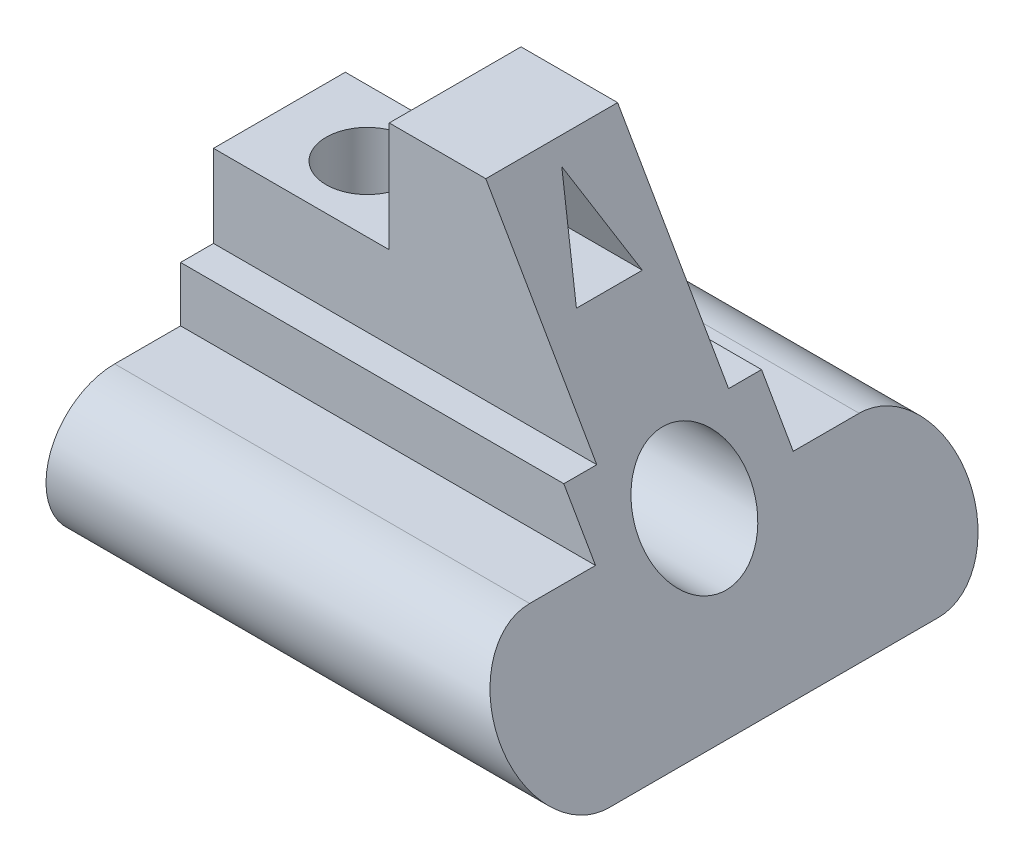
ISO-10303-21;
HEADER;
FILE_DESCRIPTION(('STEP AP214'),'2;1');
FILE_NAME('part.step','',(''),(''),'','','');
FILE_SCHEMA(('AUTOMOTIVE_DESIGN { 1 0 10303 214 1 1 1 1 }'));
ENDSEC;
DATA;
#1=APPLICATION_CONTEXT('core data for automotive mechanical design processes');
#2=APPLICATION_PROTOCOL_DEFINITION('international standard','automotive_design',2000,#1);
#3=PRODUCT_CONTEXT('',#1,'mechanical');
#4=PRODUCT('Part','Part','',(#3));
#5=PRODUCT_RELATED_PRODUCT_CATEGORY('part','',(#4));
#6=PRODUCT_DEFINITION_FORMATION('','',#4);
#7=PRODUCT_DEFINITION_CONTEXT('part definition',#1,'design');
#8=PRODUCT_DEFINITION('design','',#6,#7);
#9=PRODUCT_DEFINITION_SHAPE('','',#8);
#10=(LENGTH_UNIT() NAMED_UNIT(*) SI_UNIT(.MILLI.,.METRE.));
#11=(NAMED_UNIT(*) PLANE_ANGLE_UNIT() SI_UNIT($,.RADIAN.));
#12=(NAMED_UNIT(*) SI_UNIT($,.STERADIAN.) SOLID_ANGLE_UNIT());
#13=UNCERTAINTY_MEASURE_WITH_UNIT(LENGTH_MEASURE(1.E-05),#10,'distance_accuracy_value','');
#14=(GEOMETRIC_REPRESENTATION_CONTEXT(3) GLOBAL_UNCERTAINTY_ASSIGNED_CONTEXT((#13)) GLOBAL_UNIT_ASSIGNED_CONTEXT((#10,
#11,#12)) REPRESENTATION_CONTEXT('',''));
#15=CARTESIAN_POINT('',(0.,0.,0.));
#16=DIRECTION('',(0.,0.,1.));
#17=DIRECTION('',(1.,0.,0.));
#18=AXIS2_PLACEMENT_3D('',#15,#16,#17);
#19=CARTESIAN_POINT('',(90.,0.,-30.));
#20=DIRECTION('',(-1.,0.,0.));
#21=DIRECTION('',(0.,0.,1.));
#22=AXIS2_PLACEMENT_3D('',#19,#20,#21);
#23=CYLINDRICAL_SURFACE('',#22,12.5);
#24=CARTESIAN_POINT('',(82.7831216351296,0.,-30.));
#25=DIRECTION('',(0.866025403784438,0.500000000000001,0.));
#26=DIRECTION('',(-0.500000000000001,0.866025403784438,0.));
#27=AXIS2_PLACEMENT_3D('',#24,#25,#26);
#28=ELLIPSE('',#27,14.4337567297407,12.5);
#29=CARTESIAN_POINT('',(90.,-12.5,-30.));
#30=VERTEX_POINT('',#29);
#31=CARTESIAN_POINT('',(75.5662432702593,12.5,-30.));
#32=VERTEX_POINT('',#31);
#33=EDGE_CURVE('E233',#30,#32,#28,.T.);
#34=ORIENTED_EDGE('',*,*,#33,.F.);
#35=DIRECTION('',(-1.,0.,0.));
#36=VECTOR('',#35,1.);
#37=CARTESIAN_POINT('',(90.,-12.5,-30.));
#38=LINE('',#37,#36);
#39=CARTESIAN_POINT('',(0.,-12.5,-30.));
#40=VERTEX_POINT('',#39);
#41=EDGE_CURVE('E11',#30,#40,#38,.T.);
#42=ORIENTED_EDGE('',*,*,#41,.T.);
#43=CARTESIAN_POINT('',(0.,0.,-30.));
#44=DIRECTION('',(1.,0.,0.));
#45=DIRECTION('',(0.,0.,-1.));
#46=AXIS2_PLACEMENT_3D('',#43,#44,#45);
#47=CIRCLE('',#46,12.5);
#48=CARTESIAN_POINT('',(0.,12.5,-30.));
#49=VERTEX_POINT('',#48);
#50=EDGE_CURVE('E406',#40,#49,#47,.T.);
#51=ORIENTED_EDGE('',*,*,#50,.T.);
#52=DIRECTION('',(-1.,0.,0.));
#53=VECTOR('',#52,1.);
#54=CARTESIAN_POINT('',(90.,12.5,-30.));
#55=LINE('',#54,#53);
#56=EDGE_CURVE('E51',#32,#49,#55,.T.);
#57=ORIENTED_EDGE('',*,*,#56,.F.);
#58=EDGE_LOOP('',(#34,#42,#51,#57));
#59=FACE_BOUND('',#58,.T.);
#60=ADVANCED_FACE('F41',(#59),#23,.T.);
#61=CARTESIAN_POINT('',(90.,12.5,0.));
#62=DIRECTION('',(0.,1.,0.));
#63=DIRECTION('',(0.,0.,1.));
#64=AXIS2_PLACEMENT_3D('',#61,#62,#63);
#65=PLANE('',#64);
#66=DIRECTION('',(-1.,0.,0.));
#67=VECTOR('',#66,1.);
#68=CARTESIAN_POINT('',(90.,12.5,-18.));
#69=LINE('',#68,#67);
#70=CARTESIAN_POINT('',(75.5662432702593,12.5,-18.));
#71=VERTEX_POINT('',#70);
#72=CARTESIAN_POINT('',(0.,12.5,-18.));
#73=VERTEX_POINT('',#72);
#74=EDGE_CURVE('E396',#71,#73,#69,.T.);
#75=ORIENTED_EDGE('',*,*,#74,.F.);
#76=DIRECTION('',(0.,0.,-1.));
#77=VECTOR('',#76,1.);
#78=CARTESIAN_POINT('',(75.5662432702593,12.5,0.));
#79=LINE('',#78,#77);
#80=EDGE_CURVE('E229',#71,#32,#79,.T.);
#81=ORIENTED_EDGE('',*,*,#80,.T.);
#82=ORIENTED_EDGE('',*,*,#56,.T.);
#83=DIRECTION('',(0.,0.,-1.));
#84=VECTOR('',#83,1.);
#85=CARTESIAN_POINT('',(0.,12.5,0.));
#86=LINE('',#85,#84);
#87=EDGE_CURVE('E405',#73,#49,#86,.T.);
#88=ORIENTED_EDGE('',*,*,#87,.F.);
#89=EDGE_LOOP('',(#75,#81,#82,#88));
#90=FACE_BOUND('',#89,.T.);
#91=ADVANCED_FACE('F264',(#90),#65,.T.);
#92=CARTESIAN_POINT('',(90.,0.,-18.));
#93=DIRECTION('',(0.,0.,1.));
#94=DIRECTION('',(1.,0.,0.));
#95=AXIS2_PLACEMENT_3D('',#92,#93,#94);
#96=PLANE('',#95);
#97=DIRECTION('',(-0.500000000000001,0.866025403784438,0.));
#98=VECTOR('',#97,1.);
#99=CARTESIAN_POINT('',(84.5873412263472,-3.12500000000002,-18.));
#100=LINE('',#99,#98);
#101=CARTESIAN_POINT('',(69.792740578363,22.5,-18.));
#102=VERTEX_POINT('',#101);
#103=EDGE_CURVE('E226',#71,#102,#100,.T.);
#104=ORIENTED_EDGE('',*,*,#103,.F.);
#105=ORIENTED_EDGE('',*,*,#74,.T.);
#106=DIRECTION('',(0.,1.,0.));
#107=VECTOR('',#106,1.);
#108=CARTESIAN_POINT('',(0.,0.,-18.));
#109=LINE('',#108,#107);
#110=CARTESIAN_POINT('',(0.,22.5,-18.));
#111=VERTEX_POINT('',#110);
#112=EDGE_CURVE('E416',#73,#111,#109,.T.);
#113=ORIENTED_EDGE('',*,*,#112,.T.);
#114=DIRECTION('',(-1.,0.,0.));
#115=VECTOR('',#114,1.);
#116=CARTESIAN_POINT('',(90.,22.5,-18.));
#117=LINE('',#116,#115);
#118=EDGE_CURVE('E393',#102,#111,#117,.T.);
#119=ORIENTED_EDGE('',*,*,#118,.F.);
#120=EDGE_LOOP('',(#104,#105,#113,#119));
#121=FACE_BOUND('',#120,.T.);
#122=ADVANCED_FACE('F269',(#121),#96,.F.);
#123=CARTESIAN_POINT('',(90.,22.5,0.));
#124=DIRECTION('',(0.,1.,0.));
#125=DIRECTION('',(0.,0.,1.));
#126=AXIS2_PLACEMENT_3D('',#123,#124,#125);
#127=PLANE('',#126);
#128=DIRECTION('',(-1.,0.,0.));
#129=VECTOR('',#128,1.);
#130=CARTESIAN_POINT('',(90.,22.5,-12.));
#131=LINE('',#130,#129);
#132=CARTESIAN_POINT('',(69.792740578363,22.5,-12.));
#133=VERTEX_POINT('',#132);
#134=CARTESIAN_POINT('',(0.,22.5,-12.));
#135=VERTEX_POINT('',#134);
#136=EDGE_CURVE('E390',#133,#135,#131,.T.);
#137=ORIENTED_EDGE('',*,*,#136,.F.);
#138=DIRECTION('',(0.,0.,-1.));
#139=VECTOR('',#138,1.);
#140=CARTESIAN_POINT('',(69.792740578363,22.5,0.));
#141=LINE('',#140,#139);
#142=EDGE_CURVE('E222',#133,#102,#141,.T.);
#143=ORIENTED_EDGE('',*,*,#142,.T.);
#144=ORIENTED_EDGE('',*,*,#118,.T.);
#145=DIRECTION('',(0.,0.,-1.));
#146=VECTOR('',#145,1.);
#147=CARTESIAN_POINT('',(0.,22.5,0.));
#148=LINE('',#147,#146);
#149=EDGE_CURVE('E358',#135,#111,#148,.T.);
#150=ORIENTED_EDGE('',*,*,#149,.F.);
#151=EDGE_LOOP('',(#137,#143,#144,#150));
#152=FACE_BOUND('',#151,.T.);
#153=ADVANCED_FACE('F277',(#152),#127,.T.);
#154=CARTESIAN_POINT('',(90.,0.,-12.));
#155=DIRECTION('',(0.,0.,1.));
#156=DIRECTION('',(1.,0.,0.));
#157=AXIS2_PLACEMENT_3D('',#154,#155,#156);
#158=PLANE('',#157);
#159=DIRECTION('',(-0.500000000000001,0.866025403784438,0.));
#160=VECTOR('',#159,1.);
#161=CARTESIAN_POINT('',(84.5873412263472,-3.12500000000002,-12.));
#162=LINE('',#161,#160);
#163=CARTESIAN_POINT('',(49.5854811567261,57.5,-12.));
#164=VERTEX_POINT('',#163);
#165=EDGE_CURVE('E219',#133,#164,#162,.T.);
#166=ORIENTED_EDGE('',*,*,#165,.F.);
#167=ORIENTED_EDGE('',*,*,#136,.T.);
#168=DIRECTION('',(0.,1.,0.));
#169=VECTOR('',#168,1.);
#170=CARTESIAN_POINT('',(0.,0.,-12.));
#171=LINE('',#170,#169);
#172=CARTESIAN_POINT('',(0.,37.5,-12.));
#173=VERTEX_POINT('',#172);
#174=EDGE_CURVE('E352',#135,#173,#171,.T.);
#175=ORIENTED_EDGE('',*,*,#174,.T.);
#176=DIRECTION('',(-1.,0.,0.));
#177=VECTOR('',#176,1.);
#178=CARTESIAN_POINT('',(0.,37.5,-12.));
#179=LINE('',#178,#177);
#180=CARTESIAN_POINT('',(32.,37.5,-12.));
#181=VERTEX_POINT('',#180);
#182=EDGE_CURVE('E332',#181,#173,#179,.T.);
#183=ORIENTED_EDGE('',*,*,#182,.F.);
#184=DIRECTION('',(0.,1.,0.));
#185=VECTOR('',#184,1.);
#186=CARTESIAN_POINT('',(32.,37.5,-12.));
#187=LINE('',#186,#185);
#188=CARTESIAN_POINT('',(32.,57.5,-12.));
#189=VERTEX_POINT('',#188);
#190=EDGE_CURVE('E445',#181,#189,#187,.T.);
#191=ORIENTED_EDGE('',*,*,#190,.T.);
#192=DIRECTION('',(-1.,0.,0.));
#193=VECTOR('',#192,1.);
#194=CARTESIAN_POINT('',(90.,57.5,-12.));
#195=LINE('',#194,#193);
#196=EDGE_CURVE('E387',#164,#189,#195,.T.);
#197=ORIENTED_EDGE('',*,*,#196,.F.);
#198=EDGE_LOOP('',(#166,#167,#175,#183,#191,#197));
#199=FACE_BOUND('',#198,.T.);
#200=ADVANCED_FACE('F279',(#199),#158,.F.);
#201=CARTESIAN_POINT('',(90.,57.5,0.));
#202=DIRECTION('',(0.,1.,0.));
#203=DIRECTION('',(0.,0.,1.));
#204=AXIS2_PLACEMENT_3D('',#201,#202,#203);
#205=PLANE('',#204);
#206=DIRECTION('',(-1.,0.,0.));
#207=VECTOR('',#206,1.);
#208=CARTESIAN_POINT('',(90.,57.5,12.));
#209=LINE('',#208,#207);
#210=CARTESIAN_POINT('',(49.5854811567261,57.5,12.));
#211=VERTEX_POINT('',#210);
#212=CARTESIAN_POINT('',(32.,57.5,12.));
#213=VERTEX_POINT('',#212);
#214=EDGE_CURVE('E384',#211,#213,#209,.T.);
#215=ORIENTED_EDGE('',*,*,#214,.F.);
#216=DIRECTION('',(0.,0.,1.));
#217=VECTOR('',#216,1.);
#218=CARTESIAN_POINT('',(49.5854811567261,57.5,-42.5));
#219=LINE('',#218,#217);
#220=EDGE_CURVE('E197',#164,#211,#219,.T.);
#221=ORIENTED_EDGE('',*,*,#220,.F.);
#222=ORIENTED_EDGE('',*,*,#196,.T.);
#223=DIRECTION('',(0.,0.,-1.));
#224=VECTOR('',#223,1.);
#225=CARTESIAN_POINT('',(32.,57.5,-12.));
#226=LINE('',#225,#224);
#227=EDGE_CURVE('E338',#213,#189,#226,.T.);
#228=ORIENTED_EDGE('',*,*,#227,.F.);
#229=EDGE_LOOP('',(#215,#221,#222,#228));
#230=FACE_BOUND('',#229,.T.);
#231=ADVANCED_FACE('F282',(#230),#205,.T.);
#232=CARTESIAN_POINT('',(90.,0.,12.));
#233=DIRECTION('',(0.,0.,1.));
#234=DIRECTION('',(1.,0.,0.));
#235=AXIS2_PLACEMENT_3D('',#232,#233,#234);
#236=PLANE('',#235);
#237=DIRECTION('',(-1.,0.,0.));
#238=VECTOR('',#237,1.);
#239=CARTESIAN_POINT('',(90.,22.5,12.));
#240=LINE('',#239,#238);
#241=CARTESIAN_POINT('',(69.792740578363,22.5,12.));
#242=VERTEX_POINT('',#241);
#243=CARTESIAN_POINT('',(0.,22.5,12.));
#244=VERTEX_POINT('',#243);
#245=EDGE_CURVE('E381',#242,#244,#240,.T.);
#246=ORIENTED_EDGE('',*,*,#245,.F.);
#247=DIRECTION('',(-0.500000000000001,0.866025403784438,0.));
#248=VECTOR('',#247,1.);
#249=CARTESIAN_POINT('',(84.5873412263472,-3.12500000000002,12.));
#250=LINE('',#249,#248);
#251=EDGE_CURVE('E215',#242,#211,#250,.T.);
#252=ORIENTED_EDGE('',*,*,#251,.T.);
#253=ORIENTED_EDGE('',*,*,#214,.T.);
#254=DIRECTION('',(0.,1.,0.));
#255=VECTOR('',#254,1.);
#256=CARTESIAN_POINT('',(32.,37.5,12.));
#257=LINE('',#256,#255);
#258=CARTESIAN_POINT('',(32.,37.5,12.));
#259=VERTEX_POINT('',#258);
#260=EDGE_CURVE('E344',#259,#213,#257,.T.);
#261=ORIENTED_EDGE('',*,*,#260,.F.);
#262=DIRECTION('',(1.,0.,0.));
#263=VECTOR('',#262,1.);
#264=CARTESIAN_POINT('',(0.,37.5,12.));
#265=LINE('',#264,#263);
#266=CARTESIAN_POINT('',(0.,37.5,12.));
#267=VERTEX_POINT('',#266);
#268=EDGE_CURVE('E329',#267,#259,#265,.T.);
#269=ORIENTED_EDGE('',*,*,#268,.F.);
#270=DIRECTION('',(0.,1.,0.));
#271=VECTOR('',#270,1.);
#272=CARTESIAN_POINT('',(0.,0.,12.));
#273=LINE('',#272,#271);
#274=EDGE_CURVE('E341',#244,#267,#273,.T.);
#275=ORIENTED_EDGE('',*,*,#274,.F.);
#276=EDGE_LOOP('',(#246,#252,#253,#261,#269,#275));
#277=FACE_BOUND('',#276,.T.);
#278=ADVANCED_FACE('F286',(#277),#236,.T.);
#279=DIRECTION('',(-1.,0.,0.));
#280=VECTOR('',#279,1.);
#281=CARTESIAN_POINT('',(90.,22.5,18.));
#282=LINE('',#281,#280);
#283=CARTESIAN_POINT('',(69.792740578363,22.5,18.));
#284=VERTEX_POINT('',#283);
#285=CARTESIAN_POINT('',(0.,22.5,18.));
#286=VERTEX_POINT('',#285);
#287=EDGE_CURVE('E378',#284,#286,#282,.T.);
#288=ORIENTED_EDGE('',*,*,#287,.F.);
#289=DIRECTION('',(0.,0.,-1.));
#290=VECTOR('',#289,1.);
#291=CARTESIAN_POINT('',(69.792740578363,22.5,0.));
#292=LINE('',#291,#290);
#293=EDGE_CURVE('E211',#284,#242,#292,.T.);
#294=ORIENTED_EDGE('',*,*,#293,.T.);
#295=ORIENTED_EDGE('',*,*,#245,.T.);
#296=EDGE_CURVE('E350',#286,#244,#148,.T.);
#297=ORIENTED_EDGE('',*,*,#296,.F.);
#298=EDGE_LOOP('',(#288,#294,#295,#297));
#299=FACE_BOUND('',#298,.T.);
#300=ADVANCED_FACE('F290',(#299),#127,.T.);
#301=CARTESIAN_POINT('',(90.,0.,18.));
#302=DIRECTION('',(0.,0.,1.));
#303=DIRECTION('',(1.,0.,0.));
#304=AXIS2_PLACEMENT_3D('',#301,#302,#303);
#305=PLANE('',#304);
#306=DIRECTION('',(-1.,0.,0.));
#307=VECTOR('',#306,1.);
#308=CARTESIAN_POINT('',(90.,12.5,18.));
#309=LINE('',#308,#307);
#310=CARTESIAN_POINT('',(75.5662432702593,12.5,18.));
#311=VERTEX_POINT('',#310);
#312=CARTESIAN_POINT('',(0.,12.5,18.));
#313=VERTEX_POINT('',#312);
#314=EDGE_CURVE('E375',#311,#313,#309,.T.);
#315=ORIENTED_EDGE('',*,*,#314,.F.);
#316=DIRECTION('',(-0.500000000000001,0.866025403784438,0.));
#317=VECTOR('',#316,1.);
#318=CARTESIAN_POINT('',(84.5873412263472,-3.12500000000002,18.));
#319=LINE('',#318,#317);
#320=EDGE_CURVE('E207',#311,#284,#319,.T.);
#321=ORIENTED_EDGE('',*,*,#320,.T.);
#322=ORIENTED_EDGE('',*,*,#287,.T.);
#323=DIRECTION('',(0.,1.,0.));
#324=VECTOR('',#323,1.);
#325=CARTESIAN_POINT('',(0.,0.,18.));
#326=LINE('',#325,#324);
#327=EDGE_CURVE('E356',#313,#286,#326,.T.);
#328=ORIENTED_EDGE('',*,*,#327,.F.);
#329=EDGE_LOOP('',(#315,#321,#322,#328));
#330=FACE_BOUND('',#329,.T.);
#331=ADVANCED_FACE('F295',(#330),#305,.T.);
#332=DIRECTION('',(-1.,0.,0.));
#333=VECTOR('',#332,1.);
#334=CARTESIAN_POINT('',(90.,12.5,30.));
#335=LINE('',#334,#333);
#336=CARTESIAN_POINT('',(75.5662432702593,12.5,30.));
#337=VERTEX_POINT('',#336);
#338=CARTESIAN_POINT('',(0.,12.5,30.));
#339=VERTEX_POINT('',#338);
#340=EDGE_CURVE('E372',#337,#339,#335,.T.);
#341=ORIENTED_EDGE('',*,*,#340,.F.);
#342=DIRECTION('',(0.,0.,-1.));
#343=VECTOR('',#342,1.);
#344=CARTESIAN_POINT('',(75.5662432702593,12.5,0.));
#345=LINE('',#344,#343);
#346=EDGE_CURVE('E203',#337,#311,#345,.T.);
#347=ORIENTED_EDGE('',*,*,#346,.T.);
#348=ORIENTED_EDGE('',*,*,#314,.T.);
#349=EDGE_CURVE('E363',#339,#313,#86,.T.);
#350=ORIENTED_EDGE('',*,*,#349,.F.);
#351=EDGE_LOOP('',(#341,#347,#348,#350));
#352=FACE_BOUND('',#351,.T.);
#353=ADVANCED_FACE('F272',(#352),#65,.T.);
#354=CARTESIAN_POINT('',(90.,0.,30.));
#355=DIRECTION('',(-1.,0.,0.));
#356=DIRECTION('',(0.,0.,1.));
#357=AXIS2_PLACEMENT_3D('',#354,#355,#356);
#358=CYLINDRICAL_SURFACE('',#357,12.5);
#359=DIRECTION('',(-1.,0.,0.));
#360=VECTOR('',#359,1.);
#361=CARTESIAN_POINT('',(90.,-12.5,30.));
#362=LINE('',#361,#360);
#363=CARTESIAN_POINT('',(90.,-12.5,30.));
#364=VERTEX_POINT('',#363);
#365=CARTESIAN_POINT('',(0.,-12.5,30.));
#366=VERTEX_POINT('',#365);
#367=EDGE_CURVE('E368',#364,#366,#362,.T.);
#368=ORIENTED_EDGE('',*,*,#367,.F.);
#369=CARTESIAN_POINT('',(82.7831216351296,0.,30.));
#370=DIRECTION('',(0.866025403784438,0.500000000000001,0.));
#371=DIRECTION('',(-0.500000000000001,0.866025403784438,0.));
#372=AXIS2_PLACEMENT_3D('',#369,#370,#371);
#373=ELLIPSE('',#372,14.4337567297407,12.5);
#374=EDGE_CURVE('E200',#337,#364,#373,.T.);
#375=ORIENTED_EDGE('',*,*,#374,.F.);
#376=ORIENTED_EDGE('',*,*,#340,.T.);
#377=CARTESIAN_POINT('',(0.,0.,30.));
#378=DIRECTION('',(1.,0.,0.));
#379=DIRECTION('',(0.,0.,-1.));
#380=AXIS2_PLACEMENT_3D('',#377,#378,#379);
#381=CIRCLE('',#380,12.5);
#382=EDGE_CURVE('E364',#339,#366,#381,.T.);
#383=ORIENTED_EDGE('',*,*,#382,.T.);
#384=EDGE_LOOP('',(#368,#375,#376,#383));
#385=FACE_BOUND('',#384,.T.);
#386=ADVANCED_FACE('F299',(#385),#358,.T.);
#387=CARTESIAN_POINT('',(0.,12.5,0.));
#388=DIRECTION('',(1.,0.,0.));
#389=DIRECTION('',(0.,0.,-1.));
#390=AXIS2_PLACEMENT_3D('',#387,#388,#389);
#391=CYLINDRICAL_SURFACE('',#390,10.);
#392=CARTESIAN_POINT('',(0.,12.5,0.));
#393=DIRECTION('',(1.,0.,0.));
#394=DIRECTION('',(0.,0.,-1.));
#395=AXIS2_PLACEMENT_3D('',#392,#393,#394);
#396=CIRCLE('',#395,10.);
#397=CARTESIAN_POINT('',(0.,12.5,-10.));
#398=VERTEX_POINT('',#397);
#399=EDGE_CURVE('E448',#398,#398,#396,.T.);
#400=ORIENTED_EDGE('',*,*,#399,.F.);
#401=EDGE_LOOP('',(#400));
#402=FACE_BOUND('',#401,.T.);
#403=CARTESIAN_POINT('',(16.,19.1143782776615,7.5));
#404=CARTESIAN_POINT('',(15.8249572549436,19.1143819762977,7.49999838387404));
#405=CARTESIAN_POINT('',(15.6498808542977,19.1213667833604,7.4938544531901));
#406=CARTESIAN_POINT('',(15.301629140503,19.1488755378683,7.46945630098661));
#407=CARTESIAN_POINT('',(15.1284544812356,19.1694040024979,7.45119803899091));
#408=CARTESIAN_POINT('',(14.7853107311971,19.2228465690322,7.40301431271971));
#409=CARTESIAN_POINT('',(14.6153495874816,19.2557879953922,7.37306310366495));
#410=CARTESIAN_POINT('',(14.2801372228286,19.3323686910377,7.30215402879712));
#411=CARTESIAN_POINT('',(14.1148889068312,19.376014405774,7.26118953003702));
#412=CARTESIAN_POINT('',(13.7922843814968,19.4714122882731,7.16963772461485));
#413=CARTESIAN_POINT('',(13.6348488614235,19.5230388808097,7.11919724072745));
#414=CARTESIAN_POINT('',(13.3258070689227,19.6330548125512,7.00896652342575));
#415=CARTESIAN_POINT('',(13.1742001478636,19.6914433963341,6.94917733414978));
#416=CARTESIAN_POINT('',(12.7283912608547,19.8742648900627,6.75658060252613));
#417=CARTESIAN_POINT('',(12.4429561159274,20.0064309206662,6.61047289700965));
#418=CARTESIAN_POINT('',(12.0045891827347,20.2261231215133,6.35008921903902));
#419=CARTESIAN_POINT('',(11.8438468342474,20.3106651724496,6.24603009576815));
#420=CARTESIAN_POINT('',(11.5312809633128,20.4813714443826,6.02636084854273));
#421=CARTESIAN_POINT('',(11.3794581761644,20.5675357983455,5.91074977439961));
#422=CARTESIAN_POINT('',(11.0847989557672,20.7398365234977,5.66809334754193));
#423=CARTESIAN_POINT('',(10.941975814912,20.8259726746293,5.54103172535058));
#424=CARTESIAN_POINT('',(10.6659155407272,20.9965099624982,5.2758106015174));
#425=CARTESIAN_POINT('',(10.5326784440322,21.0809110926041,5.13765105746729));
#426=CARTESIAN_POINT('',(10.2500753078268,21.2634311882671,4.82101034978969));
#427=CARTESIAN_POINT('',(10.1029859536517,21.3608241234382,4.64006256697591));
#428=CARTESIAN_POINT('',(9.82471816772965,21.5484005327933,4.26272756958655));
#429=CARTESIAN_POINT('',(9.69354331407749,21.6385823841442,4.06633689924783));
#430=CARTESIAN_POINT('',(9.44896890691198,21.8090459714417,3.65927040592031));
#431=CARTESIAN_POINT('',(9.33553588356762,21.889346286259,3.44862258189057));
#432=CARTESIAN_POINT('',(9.12803020874927,22.0377518256957,3.01395872397104));
#433=CARTESIAN_POINT('',(9.0339473156352,22.1058634990281,2.7899498432382));
#434=CARTESIAN_POINT('',(8.89223966291101,22.2092059055031,2.39977112189463));
#435=CARTESIAN_POINT('',(8.83916237537595,22.2481569422498,2.2365426341817));
#436=CARTESIAN_POINT('',(8.74400039146747,22.3182733864817,1.90529321507478));
#437=CARTESIAN_POINT('',(8.70191306318369,22.3494406579697,1.73727344182392));
#438=CARTESIAN_POINT('',(8.62931195685325,22.4033555851054,1.39753765355224));
#439=CARTESIAN_POINT('',(8.59879045877789,22.4261088567337,1.22582418520901));
#440=CARTESIAN_POINT('',(8.5497253144985,22.4627469106704,0.879743734183572));
#441=CARTESIAN_POINT('',(8.53118209765442,22.4766313750773,0.705376656612355));
#442=CARTESIAN_POINT('',(8.50633215532745,22.4952483493686,0.354821662174915));
#443=CARTESIAN_POINT('',(8.50005762229042,22.4999567816723,0.178630171226899));
#444=CARTESIAN_POINT('',(8.49994316886393,22.500042624962,-0.173758351306062));
#445=CARTESIAN_POINT('',(8.50610319926908,22.4954200728721,-0.349955382866323));
#446=CARTESIAN_POINT('',(8.53076094068099,22.4769467065141,-0.701027604628028));
#447=CARTESIAN_POINT('',(8.54926109053118,22.4630940680556,-0.875902526623212));
#448=CARTESIAN_POINT('',(8.59831081749721,22.4264665160095,-1.22299713100227));
#449=CARTESIAN_POINT('',(8.62886031464169,22.4036916616385,-1.39521683100094));
#450=CARTESIAN_POINT('',(8.7003045909229,22.3506344903949,-1.7299446312395));
#451=CARTESIAN_POINT('',(8.740805282986,22.3206388816869,-1.89258265463914));
#452=CARTESIAN_POINT('',(8.83210989651825,22.2533432482617,-2.21341583625952));
#453=CARTESIAN_POINT('',(8.88291740526413,22.2160406805211,-2.3716094257149));
#454=CARTESIAN_POINT('',(9.04993725282845,22.094139774382,-2.83823794303705));
#455=CARTESIAN_POINT('',(9.1807996356139,21.9995084680106,-3.13896269049414));
#456=CARTESIAN_POINT('',(9.49265612952179,21.7780486437945,-3.74612986545196));
#457=CARTESIAN_POINT('',(9.6775441344509,21.6488433576637,-4.04966571864021));
#458=CARTESIAN_POINT('',(10.083684882488,21.3730187829539,-4.6228474672591));
#459=CARTESIAN_POINT('',(10.3049686146386,21.2263846844263,-4.89246413400519));
#460=CARTESIAN_POINT('',(10.6841858861074,20.985042738548,-5.29480881247807));
#461=CARTESIAN_POINT('',(10.8319091470219,20.8931092504118,-5.43905294132655));
#462=CARTESIAN_POINT('',(11.1383385742001,20.7079729662904,-5.71460427162253));
#463=CARTESIAN_POINT('',(11.2970468546929,20.6147699287499,-5.84590897083323));
#464=CARTESIAN_POINT('',(11.6251029699428,20.4291499101312,-6.09530688932279));
#465=CARTESIAN_POINT('',(11.794456387015,20.3367333708241,-6.21339308501907));
#466=CARTESIAN_POINT('',(12.1435255050019,20.1550753028725,-6.43587029403));
#467=CARTESIAN_POINT('',(12.3232388780641,20.065833068202,-6.54026436679215));
#468=CARTESIAN_POINT('',(12.6564694744362,19.9102627756245,-6.7155722654236));
#469=CARTESIAN_POINT('',(12.8081626874472,19.8428868168872,-6.78902852483034));
#470=CARTESIAN_POINT('',(13.1181713399071,19.7135350770045,-6.92631258115993));
#471=CARTESIAN_POINT('',(13.2764888466456,19.6515610005483,-6.9901373432537));
#472=CARTESIAN_POINT('',(13.5992189306193,19.534994983556,-7.10743795595147));
#473=CARTESIAN_POINT('',(13.7636200708585,19.4803900065519,-7.16093215631046));
#474=CARTESIAN_POINT('',(14.0982660166228,19.3804897167362,-7.25697383906695));
#475=CARTESIAN_POINT('',(14.2685065374623,19.3351877413874,-7.29952916110584));
#476=CARTESIAN_POINT('',(14.5798934247452,19.2637636180034,-7.36568941013316));
#477=CARTESIAN_POINT('',(14.7201343507157,19.2356201448037,-7.39137773468902));
#478=CARTESIAN_POINT('',(15.0031878856697,19.1876157405722,-7.43484020430898));
#479=CARTESIAN_POINT('',(15.1459991810131,19.167750697411,-7.45261827891484));
#480=CARTESIAN_POINT('',(15.4332521976201,19.1370802529343,-7.47994591403064));
#481=CARTESIAN_POINT('',(15.5776923300458,19.1262666864168,-7.48950289088611));
#482=CARTESIAN_POINT('',(15.8672890874666,19.1141277806667,-7.50022540461936));
#483=CARTESIAN_POINT('',(16.0124457198147,19.112802539009,-7.50139085520134));
#484=CARTESIAN_POINT('',(16.3023994585544,19.1197001525738,-7.49530453133557));
#485=CARTESIAN_POINT('',(16.4471964308891,19.1279261505457,-7.4880499863645));
#486=CARTESIAN_POINT('',(16.7353043477018,19.1535763285943,-7.46526710078138));
#487=CARTESIAN_POINT('',(16.878615290477,19.1710005192101,-7.44973875068943));
#488=CARTESIAN_POINT('',(17.1630045398484,19.2143725231157,-7.41067135494668));
#489=CARTESIAN_POINT('',(17.3040798526996,19.2403308950304,-7.38712238475188));
#490=CARTESIAN_POINT('',(17.5831713819744,19.2998396975991,-7.33238101466956));
#491=CARTESIAN_POINT('',(17.7211857610256,19.3333945596018,-7.30118415256481));
#492=CARTESIAN_POINT('',(18.0445332782046,19.4208134309528,-7.21853070164236));
#493=CARTESIAN_POINT('',(18.2282653180867,19.4775801053276,-7.16386030544521));
#494=CARTESIAN_POINT('',(18.5881690065138,19.6007024448386,-7.04184138194052));
#495=CARTESIAN_POINT('',(18.7643369507897,19.6670627402118,-6.97448672796228));
#496=CARTESIAN_POINT('',(19.1089769546677,19.8069075576654,-6.8278385772243));
#497=CARTESIAN_POINT('',(19.2774382824592,19.880401594612,-6.74852905513664));
#498=CARTESIAN_POINT('',(19.6062822485556,20.0321973859904,-6.57867589007164));
#499=CARTESIAN_POINT('',(19.766665614692,20.110498705866,-6.48813326176223));
#500=CARTESIAN_POINT('',(20.0848415957562,20.2728085772198,-6.29286343156942));
#501=CARTESIAN_POINT('',(20.2423426419905,20.3569210268405,-6.18774819123949));
#502=CARTESIAN_POINT('',(20.5485790844179,20.5264131572765,-5.96625095327431));
#503=CARTESIAN_POINT('',(20.6973114493684,20.611793263687,-5.84986509581939));
#504=CARTESIAN_POINT('',(20.9857693867153,20.7821707011248,-5.60604802897365));
#505=CARTESIAN_POINT('',(21.1254920452676,20.8671679001308,-5.47861327717321));
#506=CARTESIAN_POINT('',(21.3954907605958,21.0352307225939,-5.21292172951439));
#507=CARTESIAN_POINT('',(21.5257667223352,21.118296326613,-5.07466482481104));
#508=CARTESIAN_POINT('',(21.8037464979002,21.2988628096553,-4.75609627857783));
#509=CARTESIAN_POINT('',(21.9490352358762,21.3955501788078,-4.57319795109072));
#510=CARTESIAN_POINT('',(22.2235136913303,21.5814058313581,-4.19202039253999));
#511=CARTESIAN_POINT('',(22.3526997544016,21.6705724064771,-3.99373768658794));
#512=CARTESIAN_POINT('',(22.5930997352756,21.8387151107205,-3.58295524329397));
#513=CARTESIAN_POINT('',(22.704343990408,21.9177083950281,-3.37048038218723));
#514=CARTESIAN_POINT('',(22.9072145947648,22.0631906121545,-2.93233430317763));
#515=CARTESIAN_POINT('',(22.9988515316854,22.1296862911461,-2.70667029148958));
#516=CARTESIAN_POINT('',(23.1359468312749,22.2298651362054,-2.31458682145053));
#517=CARTESIAN_POINT('',(23.1869683220143,22.2673729015048,-2.15106438801795));
#518=CARTESIAN_POINT('',(23.277997693968,22.3345464393487,-1.81942149738112));
#519=CARTESIAN_POINT('',(23.3180082054046,22.3642140846164,-1.65130214882128));
#520=CARTESIAN_POINT('',(23.3864570936036,22.4151008614125,-1.31158500513154));
#521=CARTESIAN_POINT('',(23.4149035513172,22.4363258924087,-1.13998972731269));
#522=CARTESIAN_POINT('',(23.4598488813692,22.4699108170673,-0.794368064329065));
#523=CARTESIAN_POINT('',(23.4763473072994,22.4822703794936,-0.620341588576259));
#524=CARTESIAN_POINT('',(23.4971619237763,22.4978692269185,-0.2707372368656));
#525=CARTESIAN_POINT('',(23.5014492290255,22.5010868867835,-0.0951566662831998));
#526=CARTESIAN_POINT('',(23.4976905748667,22.4982679742291,0.255796459899273));
#527=CARTESIAN_POINT('',(23.4896446687018,22.4922314417605,0.431169016394082));
#528=CARTESIAN_POINT('',(23.4613448078041,22.4710369863292,0.78040586008748));
#529=CARTESIAN_POINT('',(23.4410880997606,22.4558770061986,0.954269798148919));
#530=CARTESIAN_POINT('',(23.3886777147875,22.4167663538167,1.2991821950527));
#531=CARTESIAN_POINT('',(23.3565240705067,22.3928157056896,1.4702306616202));
#532=CARTESIAN_POINT('',(23.2818930770913,22.3374467378172,1.80341707766248));
#533=CARTESIAN_POINT('',(23.2397463411901,22.3062681638195,1.96566921370885));
#534=CARTESIAN_POINT('',(23.1452030929435,22.2366786515487,2.28559292852836));
#535=CARTESIAN_POINT('',(23.0928030035285,22.1982651894286,2.44326288661391));
#536=CARTESIAN_POINT('',(22.9211022577448,22.0731629903043,2.90814334154298));
#537=CARTESIAN_POINT('',(22.787246052956,21.9765709506703,3.20746548927606));
#538=CARTESIAN_POINT('',(22.4686016817556,21.7508781499841,3.81278372377712));
#539=CARTESIAN_POINT('',(22.2797616473831,21.6193343117864,4.11569486640104));
#540=CARTESIAN_POINT('',(21.8656514779907,21.3392586119775,4.68708538623883));
#541=CARTESIAN_POINT('',(21.6403478602624,21.1907111738527,4.95553270683285));
#542=CARTESIAN_POINT('',(21.2544765315874,20.9467182934225,5.35573297787664));
#543=CARTESIAN_POINT('',(21.104146066386,20.8538469061871,5.49915593102943));
#544=CARTESIAN_POINT('',(20.7924136948271,20.6671063077942,5.77284943140311));
#545=CARTESIAN_POINT('',(20.6310095356415,20.5732368969011,5.9031172889523));
#546=CARTESIAN_POINT('',(20.2974657142996,20.3866399911287,6.15019469285749));
#547=CARTESIAN_POINT('',(20.1253212970378,20.2939130241209,6.26699821194907));
#548=CARTESIAN_POINT('',(19.7705492717951,20.1120849003827,6.48663766052408));
#549=CARTESIAN_POINT('',(19.5879243890783,20.0229828112717,6.58947719789704));
#550=CARTESIAN_POINT('',(19.2528647843591,19.8698034289091,6.75989283434652));
#551=CARTESIAN_POINT('',(19.1024308443129,19.8044782891229,6.83028750809666));
#552=CARTESIAN_POINT('',(18.7951976573882,19.6793755469409,6.96166587273862));
#553=CARTESIAN_POINT('',(18.6383969369328,19.6195992394514,7.02264736910912));
#554=CARTESIAN_POINT('',(18.3190246327029,19.5075387702972,7.13446998009631));
#555=CARTESIAN_POINT('',(18.1564671557325,19.4552376880863,7.18533410159404));
#556=CARTESIAN_POINT('',(17.8258231864492,19.359921971265,7.27638652915951));
#557=CARTESIAN_POINT('',(17.6577391014307,19.3169033535423,7.31657941597486));
#558=CARTESIAN_POINT('',(17.2461176498848,19.2266503530806,7.39982855789616));
#559=CARTESIAN_POINT('',(17.0000862192167,19.185011615971,7.4372125818488));
#560=CARTESIAN_POINT('',(16.6271090287445,19.1428821124111,7.47478587010325));
#561=CARTESIAN_POINT('',(16.5021205984716,19.1322270153184,7.48422651957545));
#562=CARTESIAN_POINT('',(16.2514271626069,19.1179742748226,7.49683371584342));
#563=CARTESIAN_POINT('',(16.1257222621754,19.1143756211623,7.50000116076226));
#564=CARTESIAN_POINT('',(16.,19.1143782776615,7.5));
#565=B_SPLINE_CURVE_WITH_KNOTS('',3,(#403,#404,#405,#406,#407,#408,#409,#410,#411,#412,#413,
#414,#415,#416,#417,#418,#419,#420,#421,#422,#423,#424,#425,#426,#427,#428,#429,#430,#431,#432,
#433,#434,#435,#436,#437,#438,#439,#440,#441,#442,#443,#444,#445,#446,#447,#448,#449,#450,#451,
#452,#453,#454,#455,#456,#457,#458,#459,#460,#461,#462,#463,#464,#465,#466,#467,#468,#469,#470,
#471,#472,#473,#474,#475,#476,#477,#478,#479,#480,#481,#482,#483,#484,#485,#486,#487,#488,#489,
#490,#491,#492,#493,#494,#495,#496,#497,#498,#499,#500,#501,#502,#503,#504,#505,#506,#507,#508,
#509,#510,#511,#512,#513,#514,#515,#516,#517,#518,#519,#520,#521,#522,#523,#524,#525,#526,#527,
#528,#529,#530,#531,#532,#533,#534,#535,#536,#537,#538,#539,#540,#541,#542,#543,#544,#545,#546,
#547,#548,#549,#550,#551,#552,#553,#554,#555,#556,#557,#558,#559,#560,#561,#562,#563,#564),
.UNSPECIFIED.,.T.,.F.,(4,2,2,2,2,2,2,2,2,2,2,2,2,2,2,2,2,2,2,2,2,2,2,2,2,2,2,2,2,2,2,2,2,2,2,2,
2,2,2,2,2,2,2,2,2,2,2,2,2,2,2,2,2,2,2,2,2,2,2,2,2,2,2,2,2,2,2,2,2,2,2,2,2,2,2,2,2,2,2,2,4),(0.,
0.524946654308543,1.05006848141856,1.57635306837582,2.10295533228161,2.62198622685237,
3.14095919324643,4.17811218850753,4.80566508397349,5.43326964042965,6.06178042639301,
6.69029361418684,7.44738762703936,8.20465154491874,8.96046919626115,9.71588577295535,
10.2433789495487,10.7707456843026,11.2977597865321,11.8247927784671,12.3532068340179,
12.8816187985613,13.4101352269263,13.9386481475935,14.448892861373,14.9593154709263,
15.9794159816072,17.1099698820185,18.2414914205569,18.9189650138306,19.5965693614304,
20.2745320584566,20.9523430085371,21.4964710416301,22.0407701699223,22.5840934051784,
23.1270261606961,23.5625720536543,23.9979013400772,24.4328374979326,24.8677781285273,
25.3028619129807,25.7379461959414,26.1735708106619,26.609450201141,27.2082971358611,
27.8074340672286,28.4073813950995,29.007274570122,29.6283553138709,30.2496495148833,
30.8711436522056,31.4926440410755,32.2499956478534,33.0075188193678,33.7637473732032,
34.5195665371228,35.045109601431,35.57052701867,36.0955766408919,36.6206458792658,
37.1469561368486,37.6732641223298,38.1996908249707,38.7261160829479,39.2370944402893,
39.7482513806144,40.7698210149854,41.9071133704993,43.045456033251,43.7276445027794,
44.4099721703686,45.0926041030805,45.7750593264448,46.3100858652191,46.8452369485077,
47.3791568263483,47.9128471411508,48.6669364564278,49.044026816004,49.4210631843482),.UNSPECIFIED.);
#566=CARTESIAN_POINT('',(16.,19.1143782776615,7.5));
#567=VERTEX_POINT('',#566);
#568=EDGE_CURVE('E236',#567,#567,#565,.T.);
#569=ORIENTED_EDGE('',*,*,#568,.F.);
#570=EDGE_LOOP('',(#569));
#571=FACE_BOUND('',#570,.T.);
#572=CARTESIAN_POINT('',(75.5662432702593,12.5,0.));
#573=DIRECTION('',(0.866025403784438,0.500000000000001,0.));
#574=DIRECTION('',(0.500000000000001,-0.866025403784438,0.));
#575=AXIS2_PLACEMENT_3D('',#572,#573,#574);
#576=ELLIPSE('',#575,11.5470053837925,10.);
#577=CARTESIAN_POINT('',(81.3397459621556,2.49999999999999,0.));
#578=VERTEX_POINT('',#577);
#579=EDGE_CURVE('E45',#578,#578,#576,.F.);
#580=ORIENTED_EDGE('',*,*,#579,.F.);
#581=EDGE_LOOP('',(#580));
#582=FACE_BOUND('',#581,.T.);
#583=ADVANCED_FACE('F302',(#402,#571,#582),#391,.F.);
#584=CARTESIAN_POINT('',(0.,0.,0.));
#585=DIRECTION('',(1.,0.,0.));
#586=DIRECTION('',(0.,0.,-1.));
#587=AXIS2_PLACEMENT_3D('',#584,#585,#586);
#588=PLANE('',#587);
#589=ORIENTED_EDGE('',*,*,#399,.T.);
#590=EDGE_LOOP('',(#589));
#591=FACE_BOUND('',#590,.T.);
#592=DIRECTION('',(0.,0.,1.));
#593=VECTOR('',#592,1.);
#594=CARTESIAN_POINT('',(0.,37.5,-12.));
#595=LINE('',#594,#593);
#596=EDGE_CURVE('E326',#173,#267,#595,.T.);
#597=ORIENTED_EDGE('',*,*,#596,.F.);
#598=ORIENTED_EDGE('',*,*,#174,.F.);
#599=ORIENTED_EDGE('',*,*,#149,.T.);
#600=ORIENTED_EDGE('',*,*,#112,.F.);
#601=ORIENTED_EDGE('',*,*,#87,.T.);
#602=ORIENTED_EDGE('',*,*,#50,.F.);
#603=DIRECTION('',(0.,0.,-1.));
#604=VECTOR('',#603,1.);
#605=CARTESIAN_POINT('',(0.,-12.5,0.));
#606=LINE('',#605,#604);
#607=EDGE_CURVE('E411',#366,#40,#606,.T.);
#608=ORIENTED_EDGE('',*,*,#607,.F.);
#609=ORIENTED_EDGE('',*,*,#382,.F.);
#610=ORIENTED_EDGE('',*,*,#349,.T.);
#611=ORIENTED_EDGE('',*,*,#327,.T.);
#612=ORIENTED_EDGE('',*,*,#296,.T.);
#613=ORIENTED_EDGE('',*,*,#274,.T.);
#614=EDGE_LOOP('',(#597,#598,#599,#600,#601,#602,#608,#609,#610,#611,#612,#613));
#615=FACE_BOUND('',#614,.T.);
#616=ADVANCED_FACE('F304',(#591,#615),#588,.F.);
#617=CARTESIAN_POINT('',(90.,-12.5,0.));
#618=DIRECTION('',(0.,1.,0.));
#619=DIRECTION('',(0.,0.,1.));
#620=AXIS2_PLACEMENT_3D('',#617,#618,#619);
#621=PLANE('',#620);
#622=ORIENTED_EDGE('',*,*,#607,.T.);
#623=ORIENTED_EDGE('',*,*,#41,.F.);
#624=DIRECTION('',(0.,0.,-1.));
#625=VECTOR('',#624,1.);
#626=CARTESIAN_POINT('',(90.,-12.5,0.));
#627=LINE('',#626,#625);
#628=EDGE_CURVE('E367',#364,#30,#627,.T.);
#629=ORIENTED_EDGE('',*,*,#628,.F.);
#630=ORIENTED_EDGE('',*,*,#367,.T.);
#631=EDGE_LOOP('',(#622,#623,#629,#630));
#632=FACE_BOUND('',#631,.T.);
#633=ADVANCED_FACE('F43',(#632),#621,.F.);
#634=CARTESIAN_POINT('',(32.,37.5,-12.));
#635=DIRECTION('',(1.,0.,0.));
#636=DIRECTION('',(0.,0.,-1.));
#637=AXIS2_PLACEMENT_3D('',#634,#635,#636);
#638=PLANE('',#637);
#639=DIRECTION('',(0.,0.,1.));
#640=VECTOR('',#639,1.);
#641=CARTESIAN_POINT('',(32.,39.3163660766051,6.));
#642=LINE('',#641,#640);
#643=CARTESIAN_POINT('',(32.,39.3163660766051,-6.));
#644=VERTEX_POINT('',#643);
#645=CARTESIAN_POINT('',(32.,39.3163660766051,6.));
#646=VERTEX_POINT('',#645);
#647=EDGE_CURVE('E58',#644,#646,#642,.T.);
#648=ORIENTED_EDGE('',*,*,#647,.F.);
#649=DIRECTION('',(0.,-0.928476690885259,-0.371390676354104));
#650=VECTOR('',#649,1.);
#651=CARTESIAN_POINT('',(32.,39.3163660766051,-6.));
#652=LINE('',#651,#650);
#653=CARTESIAN_POINT('',(32.,54.3163660766051,0.));
#654=VERTEX_POINT('',#653);
#655=EDGE_CURVE('E187',#654,#644,#652,.T.);
#656=ORIENTED_EDGE('',*,*,#655,.F.);
#657=DIRECTION('',(0.,0.928476690885259,-0.371390676354104));
#658=VECTOR('',#657,1.);
#659=CARTESIAN_POINT('',(32.,54.3163660766051,0.));
#660=LINE('',#659,#658);
#661=EDGE_CURVE('E169',#646,#654,#660,.T.);
#662=ORIENTED_EDGE('',*,*,#661,.F.);
#663=EDGE_LOOP('',(#648,#656,#662));
#664=FACE_BOUND('',#663,.T.);
#665=ORIENTED_EDGE('',*,*,#227,.T.);
#666=ORIENTED_EDGE('',*,*,#190,.F.);
#667=DIRECTION('',(0.,0.,-1.));
#668=VECTOR('',#667,1.);
#669=CARTESIAN_POINT('',(32.,37.5,-12.));
#670=LINE('',#669,#668);
#671=EDGE_CURVE('E346',#259,#181,#670,.T.);
#672=ORIENTED_EDGE('',*,*,#671,.F.);
#673=ORIENTED_EDGE('',*,*,#260,.T.);
#674=EDGE_LOOP('',(#665,#666,#672,#673));
#675=FACE_BOUND('',#674,.T.);
#676=ADVANCED_FACE('F311',(#664,#675),#638,.F.);
#677=CARTESIAN_POINT('',(0.,37.5,0.));
#678=DIRECTION('',(0.,1.,0.));
#679=DIRECTION('',(0.,0.,1.));
#680=AXIS2_PLACEMENT_3D('',#677,#678,#679);
#681=PLANE('',#680);
#682=CARTESIAN_POINT('',(16.,37.5,0.));
#683=DIRECTION('',(0.,1.,0.));
#684=DIRECTION('',(0.,0.,1.));
#685=AXIS2_PLACEMENT_3D('',#682,#683,#684);
#686=CIRCLE('',#685,7.5);
#687=CARTESIAN_POINT('',(16.,37.5,7.5));
#688=VERTEX_POINT('',#687);
#689=EDGE_CURVE('E245',#688,#688,#686,.T.);
#690=ORIENTED_EDGE('',*,*,#689,.F.);
#691=EDGE_LOOP('',(#690));
#692=FACE_BOUND('',#691,.T.);
#693=ORIENTED_EDGE('',*,*,#596,.T.);
#694=ORIENTED_EDGE('',*,*,#268,.T.);
#695=ORIENTED_EDGE('',*,*,#671,.T.);
#696=ORIENTED_EDGE('',*,*,#182,.T.);
#697=EDGE_LOOP('',(#693,#694,#695,#696));
#698=FACE_BOUND('',#697,.T.);
#699=ADVANCED_FACE('F313',(#692,#698),#681,.T.);
#700=CARTESIAN_POINT('',(16.,-12.501,0.));
#701=DIRECTION('',(0.,1.,0.));
#702=DIRECTION('',(0.,0.,1.));
#703=AXIS2_PLACEMENT_3D('',#700,#701,#702);
#704=CYLINDRICAL_SURFACE('',#703,7.5);
#705=ORIENTED_EDGE('',*,*,#689,.T.);
#706=EDGE_LOOP('',(#705));
#707=FACE_BOUND('',#706,.T.);
#708=ORIENTED_EDGE('',*,*,#568,.T.);
#709=EDGE_LOOP('',(#708));
#710=FACE_BOUND('',#709,.T.);
#711=ADVANCED_FACE('F247',(#707,#710),#704,.F.);
#712=CARTESIAN_POINT('',(90.,-12.5,-42.5));
#713=DIRECTION('',(0.866025403784438,0.500000000000001,0.));
#714=DIRECTION('',(-0.500000000000001,0.866025403784438,0.));
#715=AXIS2_PLACEMENT_3D('',#712,#713,#714);
#716=PLANE('',#715);
#717=DIRECTION('',(0.472455591261535,-0.818317088384971,-0.327326835353988));
#718=VECTOR('',#717,1.);
#719=CARTESIAN_POINT('',(46.6720197987518,62.5462630979001,3.29195880851799));
#720=LINE('',#719,#718);
#721=CARTESIAN_POINT('',(51.4235530593993,54.3163660766051,0.));
#722=VERTEX_POINT('',#721);
#723=CARTESIAN_POINT('',(60.0838070972437,39.3163660766051,-6.));
#724=VERTEX_POINT('',#723);
#725=EDGE_CURVE('E179',#722,#724,#720,.T.);
#726=ORIENTED_EDGE('',*,*,#725,.T.);
#727=DIRECTION('',(0.,0.,1.));
#728=VECTOR('',#727,1.);
#729=CARTESIAN_POINT('',(60.0838070972437,39.3163660766051,6.));
#730=LINE('',#729,#728);
#731=CARTESIAN_POINT('',(60.0838070972437,39.3163660766051,6.));
#732=VERTEX_POINT('',#731);
#733=EDGE_CURVE('E173',#724,#732,#730,.T.);
#734=ORIENTED_EDGE('',*,*,#733,.T.);
#735=DIRECTION('',(-0.472455591261535,0.818317088384971,-0.327326835353988));
#736=VECTOR('',#735,1.);
#737=CARTESIAN_POINT('',(39.9448581800691,74.1980488121858,-7.95267309423226));
#738=LINE('',#737,#736);
#739=EDGE_CURVE('E161',#732,#722,#738,.T.);
#740=ORIENTED_EDGE('',*,*,#739,.T.);
#741=EDGE_LOOP('',(#726,#734,#740));
#742=FACE_BOUND('',#741,.T.);
#743=ORIENTED_EDGE('',*,*,#579,.T.);
#744=EDGE_LOOP('',(#743));
#745=FACE_BOUND('',#744,.T.);
#746=ORIENTED_EDGE('',*,*,#33,.T.);
#747=ORIENTED_EDGE('',*,*,#80,.F.);
#748=ORIENTED_EDGE('',*,*,#103,.T.);
#749=ORIENTED_EDGE('',*,*,#142,.F.);
#750=ORIENTED_EDGE('',*,*,#165,.T.);
#751=ORIENTED_EDGE('',*,*,#220,.T.);
#752=ORIENTED_EDGE('',*,*,#251,.F.);
#753=ORIENTED_EDGE('',*,*,#293,.F.);
#754=ORIENTED_EDGE('',*,*,#320,.F.);
#755=ORIENTED_EDGE('',*,*,#346,.F.);
#756=ORIENTED_EDGE('',*,*,#374,.T.);
#757=ORIENTED_EDGE('',*,*,#628,.T.);
#758=EDGE_LOOP('',(#746,#747,#748,#749,#750,#751,#752,#753,#754,#755,#756,#757));
#759=FACE_BOUND('',#758,.T.);
#760=ADVANCED_FACE('F177',(#742,#745,#759),#716,.T.);
#761=CARTESIAN_POINT('',(-0.001000000000001,39.3163660766051,-6.));
#762=DIRECTION('',(0.,0.371390676354104,-0.928476690885259));
#763=DIRECTION('',(0.,0.928476690885259,0.371390676354104));
#764=AXIS2_PLACEMENT_3D('',#761,#762,#763);
#765=PLANE('',#764);
#766=ORIENTED_EDGE('',*,*,#655,.T.);
#767=DIRECTION('',(1.,0.,0.));
#768=VECTOR('',#767,1.);
#769=CARTESIAN_POINT('',(-0.001000000000001,39.3163660766051,-6.));
#770=LINE('',#769,#768);
#771=EDGE_CURVE('E170',#644,#724,#770,.T.);
#772=ORIENTED_EDGE('',*,*,#771,.T.);
#773=ORIENTED_EDGE('',*,*,#725,.F.);
#774=DIRECTION('',(1.,0.,0.));
#775=VECTOR('',#774,1.);
#776=CARTESIAN_POINT('',(-0.001000000000001,54.3163660766051,0.));
#777=LINE('',#776,#775);
#778=EDGE_CURVE('E66',#654,#722,#777,.T.);
#779=ORIENTED_EDGE('',*,*,#778,.F.);
#780=EDGE_LOOP('',(#766,#772,#773,#779));
#781=FACE_BOUND('',#780,.T.);
#782=ADVANCED_FACE('F254',(#781),#765,.F.);
#783=CARTESIAN_POINT('',(-0.001000000000001,39.3163660766051,6.));
#784=DIRECTION('',(0.,-1.,0.));
#785=DIRECTION('',(0.,0.,-1.));
#786=AXIS2_PLACEMENT_3D('',#783,#784,#785);
#787=PLANE('',#786);
#788=ORIENTED_EDGE('',*,*,#647,.T.);
#789=DIRECTION('',(1.,0.,0.));
#790=VECTOR('',#789,1.);
#791=CARTESIAN_POINT('',(-0.001000000000001,39.3163660766051,6.));
#792=LINE('',#791,#790);
#793=EDGE_CURVE('E163',#646,#732,#792,.T.);
#794=ORIENTED_EDGE('',*,*,#793,.T.);
#795=ORIENTED_EDGE('',*,*,#733,.F.);
#796=ORIENTED_EDGE('',*,*,#771,.F.);
#797=EDGE_LOOP('',(#788,#794,#795,#796));
#798=FACE_BOUND('',#797,.T.);
#799=ADVANCED_FACE('F172',(#798),#787,.F.);
#800=CARTESIAN_POINT('',(-0.001000000000001,54.3163660766051,0.));
#801=DIRECTION('',(0.,0.371390676354104,0.928476690885259));
#802=DIRECTION('',(0.,-0.928476690885259,0.371390676354104));
#803=AXIS2_PLACEMENT_3D('',#800,#801,#802);
#804=PLANE('',#803);
#805=ORIENTED_EDGE('',*,*,#661,.T.);
#806=ORIENTED_EDGE('',*,*,#778,.T.);
#807=ORIENTED_EDGE('',*,*,#739,.F.);
#808=ORIENTED_EDGE('',*,*,#793,.F.);
#809=EDGE_LOOP('',(#805,#806,#807,#808));
#810=FACE_BOUND('',#809,.T.);
#811=ADVANCED_FACE('F162',(#810),#804,.F.);
#812=CLOSED_SHELL('',(#60,#91,#122,#153,#200,#231,#278,#300,#331,#353,#386,#583,#616,#633,#676,
#699,#711,#760,#782,#799,#811));
#813=MANIFOLD_SOLID_BREP('B2',#812);
#814=ADVANCED_BREP_SHAPE_REPRESENTATION('',(#18,#813),#14);
#815=SHAPE_DEFINITION_REPRESENTATION(#9,#814);
ENDSEC;
END-ISO-10303-21;
